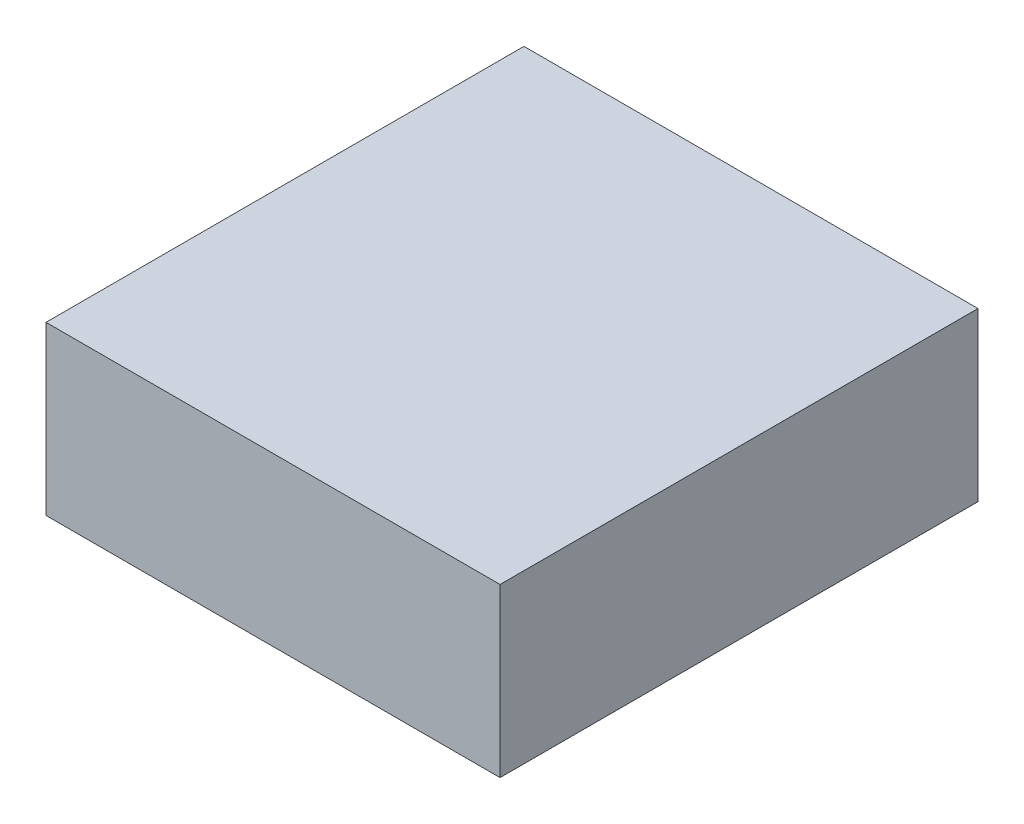
ISO-10303-21;
HEADER;
FILE_DESCRIPTION(('STEP AP214'),'2;1');
FILE_NAME('part.step','',(''),(''),'','','');
FILE_SCHEMA(('AUTOMOTIVE_DESIGN { 1 0 10303 214 1 1 1 1 }'));
ENDSEC;
DATA;
#1=APPLICATION_CONTEXT('core data for automotive mechanical design processes');
#2=APPLICATION_PROTOCOL_DEFINITION('international standard','automotive_design',2000,#1);
#3=PRODUCT_CONTEXT('',#1,'mechanical');
#4=PRODUCT('Part','Part','',(#3));
#5=PRODUCT_RELATED_PRODUCT_CATEGORY('part','',(#4));
#6=PRODUCT_DEFINITION_FORMATION('','',#4);
#7=PRODUCT_DEFINITION_CONTEXT('part definition',#1,'design');
#8=PRODUCT_DEFINITION('design','',#6,#7);
#9=PRODUCT_DEFINITION_SHAPE('','',#8);
#10=(LENGTH_UNIT() NAMED_UNIT(*) SI_UNIT(.MILLI.,.METRE.));
#11=(NAMED_UNIT(*) PLANE_ANGLE_UNIT() SI_UNIT($,.RADIAN.));
#12=(NAMED_UNIT(*) SI_UNIT($,.STERADIAN.) SOLID_ANGLE_UNIT());
#13=UNCERTAINTY_MEASURE_WITH_UNIT(LENGTH_MEASURE(1.E-05),#10,'distance_accuracy_value','');
#14=(GEOMETRIC_REPRESENTATION_CONTEXT(3) GLOBAL_UNCERTAINTY_ASSIGNED_CONTEXT((#13)) GLOBAL_UNIT_ASSIGNED_CONTEXT((#10,
#11,#12)) REPRESENTATION_CONTEXT('',''));
#15=CARTESIAN_POINT('',(0.,0.,0.));
#16=DIRECTION('',(0.,0.,1.));
#17=DIRECTION('',(1.,0.,0.));
#18=AXIS2_PLACEMENT_3D('',#15,#16,#17);
#19=CARTESIAN_POINT('',(0.47500032,0.17500346,0.));
#20=DIRECTION('',(2.67368956969514E-06,-0.999999999996426,0.));
#21=DIRECTION('',(-0.999999999996426,-2.67368956969514E-06,0.));
#22=AXIS2_PLACEMENT_3D('',#19,#20,#21);
#23=PLANE('',#22);
#24=DIRECTION('',(-0.999999999996426,-2.67368956969514E-06,0.));
#25=VECTOR('',#24,1.);
#26=CARTESIAN_POINT('',(0.47500032,0.17500346,0.));
#27=LINE('',#26,#25);
#28=CARTESIAN_POINT('',(0.47500032,0.17500346,0.));
#29=VERTEX_POINT('',#28);
#30=CARTESIAN_POINT('',(-0.47499778,0.17500092,0.));
#31=VERTEX_POINT('',#30);
#32=EDGE_CURVE('E11',#29,#31,#27,.T.);
#33=ORIENTED_EDGE('',*,*,#32,.T.);
#34=DIRECTION('',(0.,0.,1.));
#35=VECTOR('',#34,1.);
#36=CARTESIAN_POINT('',(-0.47499778,0.17500092,0.));
#37=LINE('',#36,#35);
#38=CARTESIAN_POINT('',(-0.47499778,0.17500092,1.00000054));
#39=VERTEX_POINT('',#38);
#40=EDGE_CURVE('E24',#31,#39,#37,.T.);
#41=ORIENTED_EDGE('',*,*,#40,.T.);
#42=DIRECTION('',(-0.999999999996426,-2.67368956969514E-06,0.));
#43=VECTOR('',#42,1.);
#44=CARTESIAN_POINT('',(0.47500032,0.17500346,1.00000054));
#45=LINE('',#44,#43);
#46=CARTESIAN_POINT('',(0.47500032,0.17500346,1.00000054));
#47=VERTEX_POINT('',#46);
#48=EDGE_CURVE('E87',#47,#39,#45,.T.);
#49=ORIENTED_EDGE('',*,*,#48,.F.);
#50=DIRECTION('',(0.,0.,1.));
#51=VECTOR('',#50,1.);
#52=CARTESIAN_POINT('',(0.47500032,0.17500346,0.));
#53=LINE('',#52,#51);
#54=EDGE_CURVE('E36',#29,#47,#53,.T.);
#55=ORIENTED_EDGE('',*,*,#54,.F.);
#56=EDGE_LOOP('',(#33,#41,#49,#55));
#57=FACE_BOUND('',#56,.T.);
#58=ADVANCED_FACE('F17',(#57),#23,.F.);
#59=CARTESIAN_POINT('',(-0.47499778,0.17500092,0.));
#60=DIRECTION('',(1.,0.,0.));
#61=DIRECTION('',(0.,-1.,0.));
#62=AXIS2_PLACEMENT_3D('',#59,#60,#61);
#63=PLANE('',#62);
#64=DIRECTION('',(0.,-1.,0.));
#65=VECTOR('',#64,1.);
#66=CARTESIAN_POINT('',(-0.47499778,0.17500092,0.));
#67=LINE('',#66,#65);
#68=CARTESIAN_POINT('',(-0.47499778,-0.17499838,0.));
#69=VERTEX_POINT('',#68);
#70=EDGE_CURVE('E84',#31,#69,#67,.T.);
#71=ORIENTED_EDGE('',*,*,#70,.T.);
#72=DIRECTION('',(0.,0.,1.));
#73=VECTOR('',#72,1.);
#74=CARTESIAN_POINT('',(-0.47499778,-0.17499838,0.));
#75=LINE('',#74,#73);
#76=CARTESIAN_POINT('',(-0.47499778,-0.17499838,1.00000054));
#77=VERTEX_POINT('',#76);
#78=EDGE_CURVE('E82',#69,#77,#75,.T.);
#79=ORIENTED_EDGE('',*,*,#78,.T.);
#80=DIRECTION('',(0.,-1.,0.));
#81=VECTOR('',#80,1.);
#82=CARTESIAN_POINT('',(-0.47499778,0.17500092,1.00000054));
#83=LINE('',#82,#81);
#84=EDGE_CURVE('E62',#39,#77,#83,.T.);
#85=ORIENTED_EDGE('',*,*,#84,.F.);
#86=ORIENTED_EDGE('',*,*,#40,.F.);
#87=EDGE_LOOP('',(#71,#79,#85,#86));
#88=FACE_BOUND('',#87,.T.);
#89=ADVANCED_FACE('F89',(#88),#63,.F.);
#90=CARTESIAN_POINT('',(-0.47499778,-0.17499838,0.));
#91=DIRECTION('',(2.67368955473714E-06,0.999999999996426,0.));
#92=DIRECTION('',(0.999999999996426,-2.67368955473714E-06,0.));
#93=AXIS2_PLACEMENT_3D('',#90,#91,#92);
#94=PLANE('',#93);
#95=DIRECTION('',(0.999999999996426,-2.67368955473714E-06,0.));
#96=VECTOR('',#95,1.);
#97=CARTESIAN_POINT('',(-0.47499778,-0.17499838,0.));
#98=LINE('',#97,#96);
#99=CARTESIAN_POINT('',(0.47500032,-0.17500092,0.));
#100=VERTEX_POINT('',#99);
#101=EDGE_CURVE('E71',#69,#100,#98,.T.);
#102=ORIENTED_EDGE('',*,*,#101,.T.);
#103=DIRECTION('',(0.,0.,1.));
#104=VECTOR('',#103,1.);
#105=CARTESIAN_POINT('',(0.47500032,-0.17500092,0.));
#106=LINE('',#105,#104);
#107=CARTESIAN_POINT('',(0.47500032,-0.17500092,1.00000054));
#108=VERTEX_POINT('',#107);
#109=EDGE_CURVE('E65',#100,#108,#106,.T.);
#110=ORIENTED_EDGE('',*,*,#109,.T.);
#111=DIRECTION('',(0.999999999996426,-2.67368955473714E-06,0.));
#112=VECTOR('',#111,1.);
#113=CARTESIAN_POINT('',(-0.47499778,-0.17499838,1.00000054));
#114=LINE('',#113,#112);
#115=EDGE_CURVE('E57',#77,#108,#114,.T.);
#116=ORIENTED_EDGE('',*,*,#115,.F.);
#117=ORIENTED_EDGE('',*,*,#78,.F.);
#118=EDGE_LOOP('',(#102,#110,#116,#117));
#119=FACE_BOUND('',#118,.T.);
#120=ADVANCED_FACE('F69',(#119),#94,.F.);
#121=CARTESIAN_POINT('',(0.47500032,-0.17500092,0.));
#122=DIRECTION('',(-1.,0.,0.));
#123=DIRECTION('',(0.,1.,0.));
#124=AXIS2_PLACEMENT_3D('',#121,#122,#123);
#125=PLANE('',#124);
#126=DIRECTION('',(0.,1.,0.));
#127=VECTOR('',#126,1.);
#128=CARTESIAN_POINT('',(0.47500032,-0.17500092,0.));
#129=LINE('',#128,#127);
#130=EDGE_CURVE('E66',#100,#29,#129,.T.);
#131=ORIENTED_EDGE('',*,*,#130,.T.);
#132=ORIENTED_EDGE('',*,*,#54,.T.);
#133=DIRECTION('',(0.,1.,0.));
#134=VECTOR('',#133,1.);
#135=CARTESIAN_POINT('',(0.47500032,-0.17500092,1.00000054));
#136=LINE('',#135,#134);
#137=EDGE_CURVE('E61',#108,#47,#136,.T.);
#138=ORIENTED_EDGE('',*,*,#137,.F.);
#139=ORIENTED_EDGE('',*,*,#109,.F.);
#140=EDGE_LOOP('',(#131,#132,#138,#139));
#141=FACE_BOUND('',#140,.T.);
#142=ADVANCED_FACE('F76',(#141),#125,.F.);
#143=CARTESIAN_POINT('',(0.47500032,0.17500346,0.));
#144=DIRECTION('',(0.,0.,-1.));
#145=DIRECTION('',(-1.,0.,0.));
#146=AXIS2_PLACEMENT_3D('',#143,#144,#145);
#147=PLANE('',#146);
#148=ORIENTED_EDGE('',*,*,#130,.F.);
#149=ORIENTED_EDGE('',*,*,#101,.F.);
#150=ORIENTED_EDGE('',*,*,#70,.F.);
#151=ORIENTED_EDGE('',*,*,#32,.F.);
#152=EDGE_LOOP('',(#148,#149,#150,#151));
#153=FACE_BOUND('',#152,.T.);
#154=ADVANCED_FACE('F91',(#153),#147,.T.);
#155=CARTESIAN_POINT('',(0.47500032,0.17500346,1.00000054));
#156=DIRECTION('',(0.,0.,-1.));
#157=DIRECTION('',(-1.,0.,0.));
#158=AXIS2_PLACEMENT_3D('',#155,#156,#157);
#159=PLANE('',#158);
#160=ORIENTED_EDGE('',*,*,#48,.T.);
#161=ORIENTED_EDGE('',*,*,#84,.T.);
#162=ORIENTED_EDGE('',*,*,#115,.T.);
#163=ORIENTED_EDGE('',*,*,#137,.T.);
#164=EDGE_LOOP('',(#160,#161,#162,#163));
#165=FACE_BOUND('',#164,.T.);
#166=ADVANCED_FACE('F59',(#165),#159,.F.);
#167=CLOSED_SHELL('',(#58,#89,#120,#142,#154,#166));
#168=MANIFOLD_SOLID_BREP('B1',#167);
#169=ADVANCED_BREP_SHAPE_REPRESENTATION('',(#18,#168),#14);
#170=SHAPE_DEFINITION_REPRESENTATION(#9,#169);
ENDSEC;
END-ISO-10303-21;
